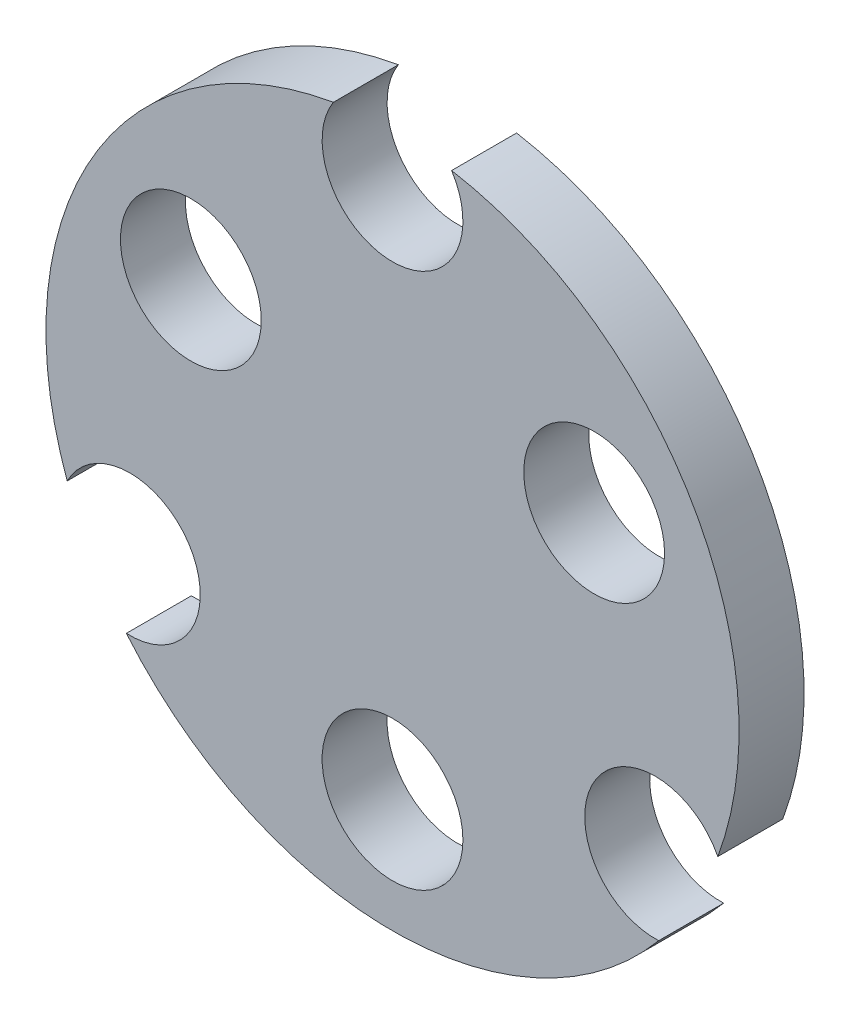
ISO-10303-21;
HEADER;
FILE_DESCRIPTION(('STEP AP214'),'2;1');
FILE_NAME('part.step','',(''),(''),'','','');
FILE_SCHEMA(('AUTOMOTIVE_DESIGN { 1 0 10303 214 1 1 1 1 }'));
ENDSEC;
DATA;
#1=APPLICATION_CONTEXT('core data for automotive mechanical design processes');
#2=APPLICATION_PROTOCOL_DEFINITION('international standard','automotive_design',2000,#1);
#3=PRODUCT_CONTEXT('',#1,'mechanical');
#4=PRODUCT('Part','Part','',(#3));
#5=PRODUCT_RELATED_PRODUCT_CATEGORY('part','',(#4));
#6=PRODUCT_DEFINITION_FORMATION('','',#4);
#7=PRODUCT_DEFINITION_CONTEXT('part definition',#1,'design');
#8=PRODUCT_DEFINITION('design','',#6,#7);
#9=PRODUCT_DEFINITION_SHAPE('','',#8);
#10=(LENGTH_UNIT() NAMED_UNIT(*) SI_UNIT(.MILLI.,.METRE.));
#11=(NAMED_UNIT(*) PLANE_ANGLE_UNIT() SI_UNIT($,.RADIAN.));
#12=(NAMED_UNIT(*) SI_UNIT($,.STERADIAN.) SOLID_ANGLE_UNIT());
#13=UNCERTAINTY_MEASURE_WITH_UNIT(LENGTH_MEASURE(1.E-05),#10,'distance_accuracy_value','');
#14=(GEOMETRIC_REPRESENTATION_CONTEXT(3) GLOBAL_UNCERTAINTY_ASSIGNED_CONTEXT((#13)) GLOBAL_UNIT_ASSIGNED_CONTEXT((#10,
#11,#12)) REPRESENTATION_CONTEXT('',''));
#15=CARTESIAN_POINT('',(0.,0.,0.));
#16=DIRECTION('',(0.,0.,1.));
#17=DIRECTION('',(1.,0.,0.));
#18=AXIS2_PLACEMENT_3D('',#15,#16,#17);
#19=CARTESIAN_POINT('',(0.,0.,3.));
#20=DIRECTION('',(0.,0.,-1.));
#21=DIRECTION('',(-1.,0.,0.));
#22=AXIS2_PLACEMENT_3D('',#19,#20,#21);
#23=CYLINDRICAL_SURFACE('',#22,16.);
#24=CARTESIAN_POINT('',(0.,0.,0.));
#25=DIRECTION('',(0.,0.,1.));
#26=DIRECTION('',(1.,0.,0.));
#27=AXIS2_PLACEMENT_3D('',#24,#25,#26);
#28=CIRCLE('',#27,16.);
#29=CARTESIAN_POINT('',(15.0177143848253,-5.51980567192474,0.));
#30=VERTEX_POINT('',#29);
#31=CARTESIAN_POINT('',(2.72856525657282,15.765625,0.));
#32=VERTEX_POINT('',#31);
#33=EDGE_CURVE('E119',#30,#32,#28,.T.);
#34=ORIENTED_EDGE('',*,*,#33,.T.);
#35=DIRECTION('',(0.,0.,-1.));
#36=VECTOR('',#35,1.);
#37=CARTESIAN_POINT('',(2.72856525657282,15.765625,3.));
#38=LINE('',#37,#36);
#39=CARTESIAN_POINT('',(2.72856525657282,15.765625,3.));
#40=VERTEX_POINT('',#39);
#41=EDGE_CURVE('E11',#40,#32,#38,.T.);
#42=ORIENTED_EDGE('',*,*,#41,.F.);
#43=CARTESIAN_POINT('',(0.,0.,3.));
#44=DIRECTION('',(0.,0.,1.));
#45=DIRECTION('',(1.,0.,0.));
#46=AXIS2_PLACEMENT_3D('',#43,#44,#45);
#47=CIRCLE('',#46,16.);
#48=CARTESIAN_POINT('',(15.0177143848253,-5.51980567192474,3.));
#49=VERTEX_POINT('',#48);
#50=EDGE_CURVE('E129',#49,#40,#47,.T.);
#51=ORIENTED_EDGE('',*,*,#50,.F.);
#52=DIRECTION('',(0.,0.,-1.));
#53=VECTOR('',#52,1.);
#54=CARTESIAN_POINT('',(15.0177143848253,-5.51980567192474,3.));
#55=LINE('',#54,#53);
#56=EDGE_CURVE('E115',#49,#30,#55,.T.);
#57=ORIENTED_EDGE('',*,*,#56,.T.);
#58=EDGE_LOOP('',(#34,#42,#51,#57));
#59=FACE_BOUND('',#58,.T.);
#60=ADVANCED_FACE('F33',(#59),#23,.T.);
#61=CARTESIAN_POINT('',(1.99573676599621E-13,14.,3.));
#62=DIRECTION('',(0.,0.,-1.));
#63=DIRECTION('',(-1.,0.,0.));
#64=AXIS2_PLACEMENT_3D('',#61,#62,#63);
#65=CYLINDRICAL_SURFACE('',#64,3.25000000000001);
#66=CARTESIAN_POINT('',(1.99573676599621E-13,14.,0.));
#67=DIRECTION('',(0.,0.,-1.));
#68=DIRECTION('',(1.,0.,0.));
#69=AXIS2_PLACEMENT_3D('',#66,#67,#68);
#70=CIRCLE('',#69,3.25000000000001);
#71=CARTESIAN_POINT('',(-2.72856525657236,15.765625,0.));
#72=VERTEX_POINT('',#71);
#73=EDGE_CURVE('E122',#32,#72,#70,.T.);
#74=ORIENTED_EDGE('',*,*,#73,.T.);
#75=DIRECTION('',(0.,0.,-1.));
#76=VECTOR('',#75,1.);
#77=CARTESIAN_POINT('',(-2.72856525657236,15.765625,3.));
#78=LINE('',#77,#76);
#79=CARTESIAN_POINT('',(-2.72856525657236,15.765625,3.));
#80=VERTEX_POINT('',#79);
#81=EDGE_CURVE('E42',#80,#72,#78,.T.);
#82=ORIENTED_EDGE('',*,*,#81,.F.);
#83=CARTESIAN_POINT('',(1.99573676599621E-13,14.,3.));
#84=DIRECTION('',(0.,0.,-1.));
#85=DIRECTION('',(1.,0.,0.));
#86=AXIS2_PLACEMENT_3D('',#83,#84,#85);
#87=CIRCLE('',#86,3.25000000000001);
#88=EDGE_CURVE('E88',#40,#80,#87,.T.);
#89=ORIENTED_EDGE('',*,*,#88,.F.);
#90=ORIENTED_EDGE('',*,*,#41,.T.);
#91=EDGE_LOOP('',(#74,#82,#89,#90));
#92=FACE_BOUND('',#91,.T.);
#93=ADVANCED_FACE('F160',(#92),#65,.F.);
#94=CARTESIAN_POINT('',(0.,0.,3.));
#95=DIRECTION('',(0.,0.,-1.));
#96=DIRECTION('',(-1.,0.,0.));
#97=AXIS2_PLACEMENT_3D('',#94,#95,#96);
#98=CYLINDRICAL_SURFACE('',#97,16.);
#99=CARTESIAN_POINT('',(0.,0.,0.));
#100=DIRECTION('',(0.,0.,1.));
#101=DIRECTION('',(1.,0.,0.));
#102=AXIS2_PLACEMENT_3D('',#99,#100,#101);
#103=CIRCLE('',#102,16.);
#104=CARTESIAN_POINT('',(-15.0177449403331,-5.51972253895959,0.));
#105=VERTEX_POINT('',#104);
#106=EDGE_CURVE('E124',#72,#105,#103,.T.);
#107=ORIENTED_EDGE('',*,*,#106,.T.);
#108=DIRECTION('',(0.,0.,-1.));
#109=VECTOR('',#108,1.);
#110=CARTESIAN_POINT('',(-15.0177449403331,-5.51972253895959,3.));
#111=LINE('',#110,#109);
#112=CARTESIAN_POINT('',(-15.0177449403331,-5.51972253895959,3.));
#113=VERTEX_POINT('',#112);
#114=EDGE_CURVE('E110',#113,#105,#111,.T.);
#115=ORIENTED_EDGE('',*,*,#114,.F.);
#116=CARTESIAN_POINT('',(0.,0.,3.));
#117=DIRECTION('',(0.,0.,1.));
#118=DIRECTION('',(1.,0.,0.));
#119=AXIS2_PLACEMENT_3D('',#116,#117,#118);
#120=CIRCLE('',#119,16.);
#121=EDGE_CURVE('E101',#80,#113,#120,.T.);
#122=ORIENTED_EDGE('',*,*,#121,.F.);
#123=ORIENTED_EDGE('',*,*,#81,.T.);
#124=EDGE_LOOP('',(#107,#115,#122,#123));
#125=FACE_BOUND('',#124,.T.);
#126=ADVANCED_FACE('F165',(#125),#98,.T.);
#127=CARTESIAN_POINT('',(-12.1249999999999,-7.00111604177258,3.));
#128=DIRECTION('',(0.,0.,-1.));
#129=DIRECTION('',(-1.,0.,0.));
#130=AXIS2_PLACEMENT_3D('',#127,#128,#129);
#131=CYLINDRICAL_SURFACE('',#130,3.25000000000001);
#132=CARTESIAN_POINT('',(-12.1249999999999,-7.00111604177258,0.));
#133=DIRECTION('',(0.,0.,-1.));
#134=DIRECTION('',(1.,0.,0.));
#135=AXIS2_PLACEMENT_3D('',#132,#133,#134);
#136=CIRCLE('',#135,3.25000000000001);
#137=CARTESIAN_POINT('',(-12.2881493043054,-10.2470184285527,0.));
#138=VERTEX_POINT('',#137);
#139=EDGE_CURVE('E109',#105,#138,#136,.T.);
#140=ORIENTED_EDGE('',*,*,#139,.T.);
#141=DIRECTION('',(0.,0.,-1.));
#142=VECTOR('',#141,1.);
#143=CARTESIAN_POINT('',(-12.2881493043054,-10.2470184285527,3.));
#144=LINE('',#143,#142);
#145=CARTESIAN_POINT('',(-12.2881493043054,-10.2470184285527,3.));
#146=VERTEX_POINT('',#145);
#147=EDGE_CURVE('E106',#146,#138,#144,.T.);
#148=ORIENTED_EDGE('',*,*,#147,.F.);
#149=CARTESIAN_POINT('',(-12.1249999999999,-7.00111604177258,3.));
#150=DIRECTION('',(0.,0.,-1.));
#151=DIRECTION('',(1.,0.,0.));
#152=AXIS2_PLACEMENT_3D('',#149,#150,#151);
#153=CIRCLE('',#152,3.25000000000001);
#154=EDGE_CURVE('E95',#113,#146,#153,.T.);
#155=ORIENTED_EDGE('',*,*,#154,.F.);
#156=ORIENTED_EDGE('',*,*,#114,.T.);
#157=EDGE_LOOP('',(#140,#148,#155,#156));
#158=FACE_BOUND('',#157,.T.);
#159=ADVANCED_FACE('F107',(#158),#131,.F.);
#160=CARTESIAN_POINT('',(0.,0.,3.));
#161=DIRECTION('',(0.,0.,-1.));
#162=DIRECTION('',(-1.,0.,0.));
#163=AXIS2_PLACEMENT_3D('',#160,#161,#162);
#164=CYLINDRICAL_SURFACE('',#163,16.);
#165=CARTESIAN_POINT('',(0.,0.,0.));
#166=DIRECTION('',(0.,0.,1.));
#167=DIRECTION('',(1.,0.,0.));
#168=AXIS2_PLACEMENT_3D('',#165,#166,#167);
#169=CIRCLE('',#168,16.);
#170=CARTESIAN_POINT('',(12.2891491282526,-10.2458193280756,0.));
#171=VERTEX_POINT('',#170);
#172=EDGE_CURVE('E74',#138,#171,#169,.T.);
#173=ORIENTED_EDGE('',*,*,#172,.T.);
#174=DIRECTION('',(0.,0.,-1.));
#175=VECTOR('',#174,1.);
#176=CARTESIAN_POINT('',(12.2891491282526,-10.2458193280756,3.));
#177=LINE('',#176,#175);
#178=CARTESIAN_POINT('',(12.2891491282526,-10.2458193280756,3.));
#179=VERTEX_POINT('',#178);
#180=EDGE_CURVE('E111',#179,#171,#177,.T.);
#181=ORIENTED_EDGE('',*,*,#180,.F.);
#182=CARTESIAN_POINT('',(0.,0.,3.));
#183=DIRECTION('',(0.,0.,1.));
#184=DIRECTION('',(1.,0.,0.));
#185=AXIS2_PLACEMENT_3D('',#182,#183,#184);
#186=CIRCLE('',#185,16.);
#187=EDGE_CURVE('E99',#146,#179,#186,.T.);
#188=ORIENTED_EDGE('',*,*,#187,.F.);
#189=ORIENTED_EDGE('',*,*,#147,.T.);
#190=EDGE_LOOP('',(#173,#181,#188,#189));
#191=FACE_BOUND('',#190,.T.);
#192=ADVANCED_FACE('F113',(#191),#164,.T.);
#193=CARTESIAN_POINT('',(12.124355652982,-7.00000000000017,3.));
#194=DIRECTION('',(0.,0.,-1.));
#195=DIRECTION('',(-1.,0.,0.));
#196=AXIS2_PLACEMENT_3D('',#193,#194,#195);
#197=CYLINDRICAL_SURFACE('',#196,3.25);
#198=CARTESIAN_POINT('',(12.124355652982,-7.00000000000017,0.));
#199=DIRECTION('',(0.,0.,-1.));
#200=DIRECTION('',(1.,0.,0.));
#201=AXIS2_PLACEMENT_3D('',#198,#199,#200);
#202=CIRCLE('',#201,3.25);
#203=EDGE_CURVE('E80',#171,#30,#202,.T.);
#204=ORIENTED_EDGE('',*,*,#203,.T.);
#205=ORIENTED_EDGE('',*,*,#56,.F.);
#206=CARTESIAN_POINT('',(12.124355652982,-7.00000000000017,3.));
#207=DIRECTION('',(0.,0.,-1.));
#208=DIRECTION('',(1.,0.,0.));
#209=AXIS2_PLACEMENT_3D('',#206,#207,#208);
#210=CIRCLE('',#209,3.25);
#211=EDGE_CURVE('E51',#179,#49,#210,.T.);
#212=ORIENTED_EDGE('',*,*,#211,.F.);
#213=ORIENTED_EDGE('',*,*,#180,.T.);
#214=EDGE_LOOP('',(#204,#205,#212,#213));
#215=FACE_BOUND('',#214,.T.);
#216=ADVANCED_FACE('F185',(#215),#197,.F.);
#217=CARTESIAN_POINT('',(0.,7.,3.));
#218=DIRECTION('',(0.,0.,1.));
#219=DIRECTION('',(1.,0.,0.));
#220=AXIS2_PLACEMENT_3D('',#217,#218,#219);
#221=PLANE('',#220);
#222=CARTESIAN_POINT('',(-9.30977309068269,5.37500000000004,3.));
#223=DIRECTION('',(0.,0.,1.));
#224=DIRECTION('',(1.,0.,0.));
#225=AXIS2_PLACEMENT_3D('',#222,#223,#224);
#226=CIRCLE('',#225,3.25);
#227=CARTESIAN_POINT('',(-6.05977309068269,5.37500000000004,3.));
#228=VERTEX_POINT('',#227);
#229=EDGE_CURVE('E138',#228,#228,#226,.T.);
#230=ORIENTED_EDGE('',*,*,#229,.F.);
#231=EDGE_LOOP('',(#230));
#232=FACE_BOUND('',#231,.T.);
#233=CARTESIAN_POINT('',(9.30977309068274,5.37500000000075,3.));
#234=DIRECTION('',(0.,0.,1.));
#235=DIRECTION('',(1.,0.,0.));
#236=AXIS2_PLACEMENT_3D('',#233,#234,#235);
#237=CIRCLE('',#236,3.25000000000082);
#238=CARTESIAN_POINT('',(12.5597730906836,5.37500000000075,3.));
#239=VERTEX_POINT('',#238);
#240=EDGE_CURVE('E178',#239,#239,#237,.T.);
#241=ORIENTED_EDGE('',*,*,#240,.F.);
#242=EDGE_LOOP('',(#241));
#243=FACE_BOUND('',#242,.T.);
#244=CARTESIAN_POINT('',(6.41850360143409E-13,-10.7499999999996,3.));
#245=DIRECTION('',(0.,0.,1.));
#246=DIRECTION('',(1.,0.,0.));
#247=AXIS2_PLACEMENT_3D('',#244,#245,#246);
#248=CIRCLE('',#247,3.25000000000031);
#249=CARTESIAN_POINT('',(3.25000000000095,-10.7499999999996,3.));
#250=VERTEX_POINT('',#249);
#251=EDGE_CURVE('E175',#250,#250,#248,.T.);
#252=ORIENTED_EDGE('',*,*,#251,.F.);
#253=EDGE_LOOP('',(#252));
#254=FACE_BOUND('',#253,.T.);
#255=ORIENTED_EDGE('',*,*,#50,.T.);
#256=ORIENTED_EDGE('',*,*,#88,.T.);
#257=ORIENTED_EDGE('',*,*,#121,.T.);
#258=ORIENTED_EDGE('',*,*,#154,.T.);
#259=ORIENTED_EDGE('',*,*,#187,.T.);
#260=ORIENTED_EDGE('',*,*,#211,.T.);
#261=EDGE_LOOP('',(#255,#256,#257,#258,#259,#260));
#262=FACE_BOUND('',#261,.T.);
#263=ADVANCED_FACE('F97',(#232,#243,#254,#262),#221,.T.);
#264=CARTESIAN_POINT('',(0.,7.,0.));
#265=DIRECTION('',(0.,0.,1.));
#266=DIRECTION('',(1.,0.,0.));
#267=AXIS2_PLACEMENT_3D('',#264,#265,#266);
#268=PLANE('',#267);
#269=CARTESIAN_POINT('',(-9.30977309068269,5.37500000000004,0.));
#270=DIRECTION('',(0.,0.,1.));
#271=DIRECTION('',(1.,0.,0.));
#272=AXIS2_PLACEMENT_3D('',#269,#270,#271);
#273=CIRCLE('',#272,3.25);
#274=CARTESIAN_POINT('',(-6.05977309068269,5.37500000000004,0.));
#275=VERTEX_POINT('',#274);
#276=EDGE_CURVE('E36',#275,#275,#273,.T.);
#277=ORIENTED_EDGE('',*,*,#276,.T.);
#278=EDGE_LOOP('',(#277));
#279=FACE_BOUND('',#278,.T.);
#280=CARTESIAN_POINT('',(9.30977309068274,5.37500000000075,0.));
#281=DIRECTION('',(0.,0.,1.));
#282=DIRECTION('',(1.,0.,0.));
#283=AXIS2_PLACEMENT_3D('',#280,#281,#282);
#284=CIRCLE('',#283,3.25000000000082);
#285=CARTESIAN_POINT('',(12.5597730906836,5.37500000000075,0.));
#286=VERTEX_POINT('',#285);
#287=EDGE_CURVE('E137',#286,#286,#284,.T.);
#288=ORIENTED_EDGE('',*,*,#287,.T.);
#289=EDGE_LOOP('',(#288));
#290=FACE_BOUND('',#289,.T.);
#291=CARTESIAN_POINT('',(6.41850360143409E-13,-10.7499999999996,0.));
#292=DIRECTION('',(0.,0.,1.));
#293=DIRECTION('',(1.,0.,0.));
#294=AXIS2_PLACEMENT_3D('',#291,#292,#293);
#295=CIRCLE('',#294,3.25000000000031);
#296=CARTESIAN_POINT('',(3.25000000000095,-10.7499999999996,0.));
#297=VERTEX_POINT('',#296);
#298=EDGE_CURVE('E135',#297,#297,#295,.T.);
#299=ORIENTED_EDGE('',*,*,#298,.T.);
#300=EDGE_LOOP('',(#299));
#301=FACE_BOUND('',#300,.T.);
#302=ORIENTED_EDGE('',*,*,#33,.F.);
#303=ORIENTED_EDGE('',*,*,#203,.F.);
#304=ORIENTED_EDGE('',*,*,#172,.F.);
#305=ORIENTED_EDGE('',*,*,#139,.F.);
#306=ORIENTED_EDGE('',*,*,#106,.F.);
#307=ORIENTED_EDGE('',*,*,#73,.F.);
#308=EDGE_LOOP('',(#302,#303,#304,#305,#306,#307));
#309=FACE_BOUND('',#308,.T.);
#310=ADVANCED_FACE('F145',(#279,#290,#301,#309),#268,.F.);
#311=CARTESIAN_POINT('',(6.41850360143409E-13,-10.7499999999996,-7.));
#312=DIRECTION('',(0.,0.,1.));
#313=DIRECTION('',(1.,0.,0.));
#314=AXIS2_PLACEMENT_3D('',#311,#312,#313);
#315=CYLINDRICAL_SURFACE('',#314,3.25000000000031);
#316=ORIENTED_EDGE('',*,*,#251,.T.);
#317=EDGE_LOOP('',(#316));
#318=FACE_BOUND('',#317,.T.);
#319=ORIENTED_EDGE('',*,*,#298,.F.);
#320=EDGE_LOOP('',(#319));
#321=FACE_BOUND('',#320,.T.);
#322=ADVANCED_FACE('F155',(#318,#321),#315,.F.);
#323=CARTESIAN_POINT('',(9.30977309068274,5.37500000000075,-7.));
#324=DIRECTION('',(0.,0.,1.));
#325=DIRECTION('',(1.,0.,0.));
#326=AXIS2_PLACEMENT_3D('',#323,#324,#325);
#327=CYLINDRICAL_SURFACE('',#326,3.25000000000082);
#328=ORIENTED_EDGE('',*,*,#240,.T.);
#329=EDGE_LOOP('',(#328));
#330=FACE_BOUND('',#329,.T.);
#331=ORIENTED_EDGE('',*,*,#287,.F.);
#332=EDGE_LOOP('',(#331));
#333=FACE_BOUND('',#332,.T.);
#334=ADVANCED_FACE('F149',(#330,#333),#327,.F.);
#335=CARTESIAN_POINT('',(-9.30977309068269,5.37500000000004,-7.));
#336=DIRECTION('',(0.,0.,1.));
#337=DIRECTION('',(1.,0.,0.));
#338=AXIS2_PLACEMENT_3D('',#335,#336,#337);
#339=CYLINDRICAL_SURFACE('',#338,3.25);
#340=ORIENTED_EDGE('',*,*,#229,.T.);
#341=EDGE_LOOP('',(#340));
#342=FACE_BOUND('',#341,.T.);
#343=ORIENTED_EDGE('',*,*,#276,.F.);
#344=EDGE_LOOP('',(#343));
#345=FACE_BOUND('',#344,.T.);
#346=ADVANCED_FACE('F147',(#342,#345),#339,.F.);
#347=CLOSED_SHELL('',(#60,#93,#126,#159,#192,#216,#263,#310,#322,#334,#346));
#348=MANIFOLD_SOLID_BREP('B2',#347);
#349=ADVANCED_BREP_SHAPE_REPRESENTATION('',(#18,#348),#14);
#350=SHAPE_DEFINITION_REPRESENTATION(#9,#349);
ENDSEC;
END-ISO-10303-21;
